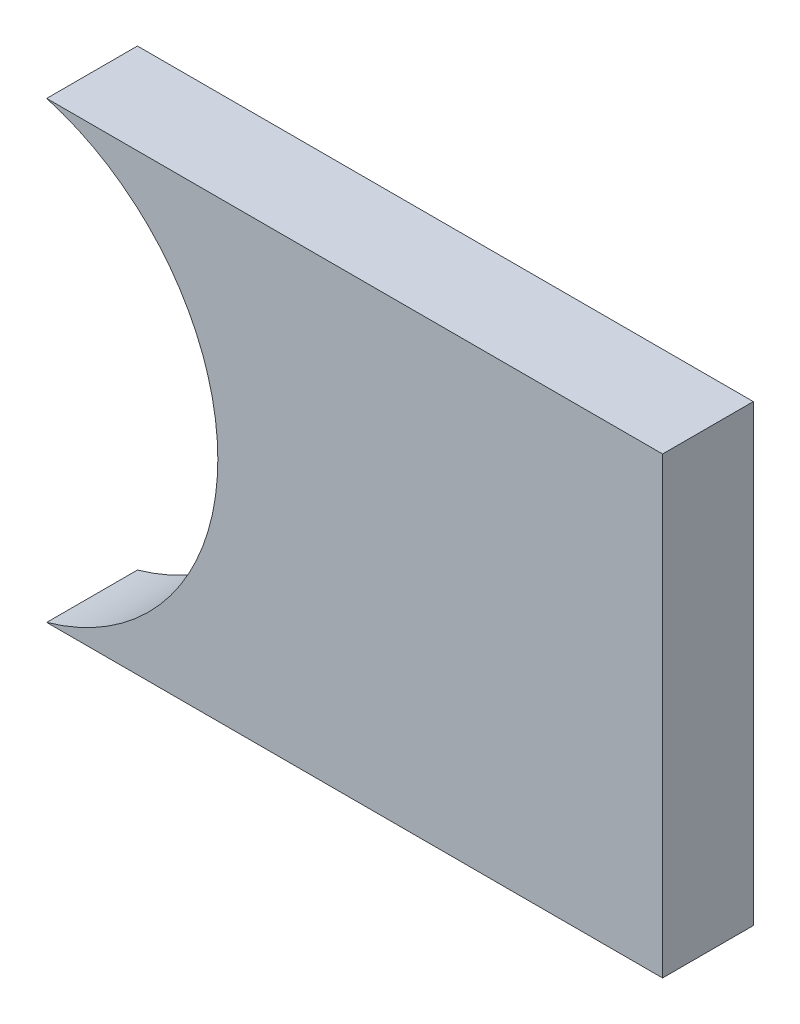
ISO-10303-21;
HEADER;
FILE_DESCRIPTION(('STEP AP214'),'2;1');
FILE_NAME('part.step','',(''),(''),'','','');
FILE_SCHEMA(('AUTOMOTIVE_DESIGN { 1 0 10303 214 1 1 1 1 }'));
ENDSEC;
DATA;
#1=APPLICATION_CONTEXT('core data for automotive mechanical design processes');
#2=APPLICATION_PROTOCOL_DEFINITION('international standard','automotive_design',2000,#1);
#3=PRODUCT_CONTEXT('',#1,'mechanical');
#4=PRODUCT('Part','Part','',(#3));
#5=PRODUCT_RELATED_PRODUCT_CATEGORY('part','',(#4));
#6=PRODUCT_DEFINITION_FORMATION('','',#4);
#7=PRODUCT_DEFINITION_CONTEXT('part definition',#1,'design');
#8=PRODUCT_DEFINITION('design','',#6,#7);
#9=PRODUCT_DEFINITION_SHAPE('','',#8);
#10=(LENGTH_UNIT() NAMED_UNIT(*) SI_UNIT(.MILLI.,.METRE.));
#11=(NAMED_UNIT(*) PLANE_ANGLE_UNIT() SI_UNIT($,.RADIAN.));
#12=(NAMED_UNIT(*) SI_UNIT($,.STERADIAN.) SOLID_ANGLE_UNIT());
#13=UNCERTAINTY_MEASURE_WITH_UNIT(LENGTH_MEASURE(1.E-05),#10,'distance_accuracy_value','');
#14=(GEOMETRIC_REPRESENTATION_CONTEXT(3) GLOBAL_UNCERTAINTY_ASSIGNED_CONTEXT((#13)) GLOBAL_UNIT_ASSIGNED_CONTEXT((#10,
#11,#12)) REPRESENTATION_CONTEXT('',''));
#15=CARTESIAN_POINT('',(0.,0.,0.));
#16=DIRECTION('',(0.,0.,1.));
#17=DIRECTION('',(1.,0.,0.));
#18=AXIS2_PLACEMENT_3D('',#15,#16,#17);
#19=CARTESIAN_POINT('',(-25.3960498225672,-10.4887996170602,2.));
#20=DIRECTION('',(0.,0.,-1.));
#21=DIRECTION('',(-1.,0.,0.));
#22=AXIS2_PLACEMENT_3D('',#19,#20,#21);
#23=CYLINDRICAL_SURFACE('',#22,5.2);
#24=CARTESIAN_POINT('',(-25.3960498225672,-10.4887996170602,0.));
#25=DIRECTION('',(0.,0.,1.));
#26=DIRECTION('',(1.,0.,0.));
#27=AXIS2_PLACEMENT_3D('',#24,#25,#26);
#28=CIRCLE('',#27,5.2);
#29=CARTESIAN_POINT('',(-23.9677641368587,-15.4887996170602,0.));
#30=VERTEX_POINT('',#29);
#31=CARTESIAN_POINT('',(-23.9677641368587,-5.4887996170602,0.));
#32=VERTEX_POINT('',#31);
#33=EDGE_CURVE('E97',#30,#32,#28,.T.);
#34=ORIENTED_EDGE('',*,*,#33,.F.);
#35=DIRECTION('',(0.,0.,-1.));
#36=VECTOR('',#35,1.);
#37=CARTESIAN_POINT('',(-23.9677641368587,-15.4887996170602,2.));
#38=LINE('',#37,#36);
#39=CARTESIAN_POINT('',(-23.9677641368587,-15.4887996170602,2.));
#40=VERTEX_POINT('',#39);
#41=EDGE_CURVE('E11',#40,#30,#38,.T.);
#42=ORIENTED_EDGE('',*,*,#41,.F.);
#43=CARTESIAN_POINT('',(-25.3960498225672,-10.4887996170602,2.));
#44=DIRECTION('',(0.,0.,1.));
#45=DIRECTION('',(1.,0.,0.));
#46=AXIS2_PLACEMENT_3D('',#43,#44,#45);
#47=CIRCLE('',#46,5.2);
#48=CARTESIAN_POINT('',(-23.9677641368587,-5.4887996170602,2.));
#49=VERTEX_POINT('',#48);
#50=EDGE_CURVE('E82',#40,#49,#47,.T.);
#51=ORIENTED_EDGE('',*,*,#50,.T.);
#52=DIRECTION('',(0.,0.,-1.));
#53=VECTOR('',#52,1.);
#54=CARTESIAN_POINT('',(-23.9677641368587,-5.4887996170602,2.));
#55=LINE('',#54,#53);
#56=EDGE_CURVE('E50',#49,#32,#55,.T.);
#57=ORIENTED_EDGE('',*,*,#56,.T.);
#58=EDGE_LOOP('',(#34,#42,#51,#57));
#59=FACE_BOUND('',#58,.T.);
#60=ADVANCED_FACE('F34',(#59),#23,.F.);
#61=CARTESIAN_POINT('',(0.,-15.4887996170602,2.));
#62=DIRECTION('',(0.,1.,0.));
#63=DIRECTION('',(0.,0.,1.));
#64=AXIS2_PLACEMENT_3D('',#61,#62,#63);
#65=PLANE('',#64);
#66=DIRECTION('',(1.,0.,0.));
#67=VECTOR('',#66,1.);
#68=CARTESIAN_POINT('',(0.,-15.4887996170602,0.));
#69=LINE('',#68,#67);
#70=CARTESIAN_POINT('',(-10.3960498225672,-15.4887996170602,0.));
#71=VERTEX_POINT('',#70);
#72=EDGE_CURVE('E88',#30,#71,#69,.T.);
#73=ORIENTED_EDGE('',*,*,#72,.T.);
#74=DIRECTION('',(0.,0.,-1.));
#75=VECTOR('',#74,1.);
#76=CARTESIAN_POINT('',(-10.3960498225672,-15.4887996170602,2.));
#77=LINE('',#76,#75);
#78=CARTESIAN_POINT('',(-10.3960498225672,-15.4887996170602,2.));
#79=VERTEX_POINT('',#78);
#80=EDGE_CURVE('E42',#79,#71,#77,.T.);
#81=ORIENTED_EDGE('',*,*,#80,.F.);
#82=DIRECTION('',(1.,0.,0.));
#83=VECTOR('',#82,1.);
#84=CARTESIAN_POINT('',(0.,-15.4887996170602,2.));
#85=LINE('',#84,#83);
#86=EDGE_CURVE('E76',#40,#79,#85,.T.);
#87=ORIENTED_EDGE('',*,*,#86,.F.);
#88=ORIENTED_EDGE('',*,*,#41,.T.);
#89=EDGE_LOOP('',(#73,#81,#87,#88));
#90=FACE_BOUND('',#89,.T.);
#91=ADVANCED_FACE('F86',(#90),#65,.F.);
#92=CARTESIAN_POINT('',(-10.3960498225672,0.,2.));
#93=DIRECTION('',(1.,0.,0.));
#94=DIRECTION('',(0.,0.,-1.));
#95=AXIS2_PLACEMENT_3D('',#92,#93,#94);
#96=PLANE('',#95);
#97=DIRECTION('',(0.,-1.,0.));
#98=VECTOR('',#97,1.);
#99=CARTESIAN_POINT('',(-10.3960498225672,0.,0.));
#100=LINE('',#99,#98);
#101=CARTESIAN_POINT('',(-10.3960498225672,-5.4887996170602,0.));
#102=VERTEX_POINT('',#101);
#103=EDGE_CURVE('E100',#102,#71,#100,.T.);
#104=ORIENTED_EDGE('',*,*,#103,.F.);
#105=DIRECTION('',(0.,0.,-1.));
#106=VECTOR('',#105,1.);
#107=CARTESIAN_POINT('',(-10.3960498225672,-5.4887996170602,2.));
#108=LINE('',#107,#106);
#109=CARTESIAN_POINT('',(-10.3960498225672,-5.4887996170602,2.));
#110=VERTEX_POINT('',#109);
#111=EDGE_CURVE('E63',#110,#102,#108,.T.);
#112=ORIENTED_EDGE('',*,*,#111,.F.);
#113=DIRECTION('',(0.,-1.,0.));
#114=VECTOR('',#113,1.);
#115=CARTESIAN_POINT('',(-10.3960498225672,0.,2.));
#116=LINE('',#115,#114);
#117=EDGE_CURVE('E81',#110,#79,#116,.T.);
#118=ORIENTED_EDGE('',*,*,#117,.T.);
#119=ORIENTED_EDGE('',*,*,#80,.T.);
#120=EDGE_LOOP('',(#104,#112,#118,#119));
#121=FACE_BOUND('',#120,.T.);
#122=ADVANCED_FACE('F91',(#121),#96,.T.);
#123=CARTESIAN_POINT('',(0.,-5.4887996170602,2.));
#124=DIRECTION('',(0.,1.,0.));
#125=DIRECTION('',(0.,0.,1.));
#126=AXIS2_PLACEMENT_3D('',#123,#124,#125);
#127=PLANE('',#126);
#128=DIRECTION('',(1.,0.,0.));
#129=VECTOR('',#128,1.);
#130=CARTESIAN_POINT('',(0.,-5.4887996170602,0.));
#131=LINE('',#130,#129);
#132=EDGE_CURVE('E102',#32,#102,#131,.T.);
#133=ORIENTED_EDGE('',*,*,#132,.F.);
#134=ORIENTED_EDGE('',*,*,#56,.F.);
#135=DIRECTION('',(1.,0.,0.));
#136=VECTOR('',#135,1.);
#137=CARTESIAN_POINT('',(0.,-5.4887996170602,2.));
#138=LINE('',#137,#136);
#139=EDGE_CURVE('E92',#49,#110,#138,.T.);
#140=ORIENTED_EDGE('',*,*,#139,.T.);
#141=ORIENTED_EDGE('',*,*,#111,.T.);
#142=EDGE_LOOP('',(#133,#134,#140,#141));
#143=FACE_BOUND('',#142,.T.);
#144=ADVANCED_FACE('F107',(#143),#127,.T.);
#145=CARTESIAN_POINT('',(0.,0.,2.));
#146=DIRECTION('',(0.,0.,1.));
#147=DIRECTION('',(1.,0.,0.));
#148=AXIS2_PLACEMENT_3D('',#145,#146,#147);
#149=PLANE('',#148);
#150=ORIENTED_EDGE('',*,*,#50,.F.);
#151=ORIENTED_EDGE('',*,*,#86,.T.);
#152=ORIENTED_EDGE('',*,*,#117,.F.);
#153=ORIENTED_EDGE('',*,*,#139,.F.);
#154=EDGE_LOOP('',(#150,#151,#152,#153));
#155=FACE_BOUND('',#154,.T.);
#156=ADVANCED_FACE('F78',(#155),#149,.T.);
#157=CARTESIAN_POINT('',(0.,0.,0.));
#158=DIRECTION('',(0.,0.,1.));
#159=DIRECTION('',(1.,0.,0.));
#160=AXIS2_PLACEMENT_3D('',#157,#158,#159);
#161=PLANE('',#160);
#162=ORIENTED_EDGE('',*,*,#33,.T.);
#163=ORIENTED_EDGE('',*,*,#132,.T.);
#164=ORIENTED_EDGE('',*,*,#103,.T.);
#165=ORIENTED_EDGE('',*,*,#72,.F.);
#166=EDGE_LOOP('',(#162,#163,#164,#165));
#167=FACE_BOUND('',#166,.T.);
#168=ADVANCED_FACE('F114',(#167),#161,.F.);
#169=CLOSED_SHELL('',(#60,#91,#122,#144,#156,#168));
#170=MANIFOLD_SOLID_BREP('B2',#169);
#171=ADVANCED_BREP_SHAPE_REPRESENTATION('',(#18,#170),#14);
#172=SHAPE_DEFINITION_REPRESENTATION(#9,#171);
ENDSEC;
END-ISO-10303-21;
